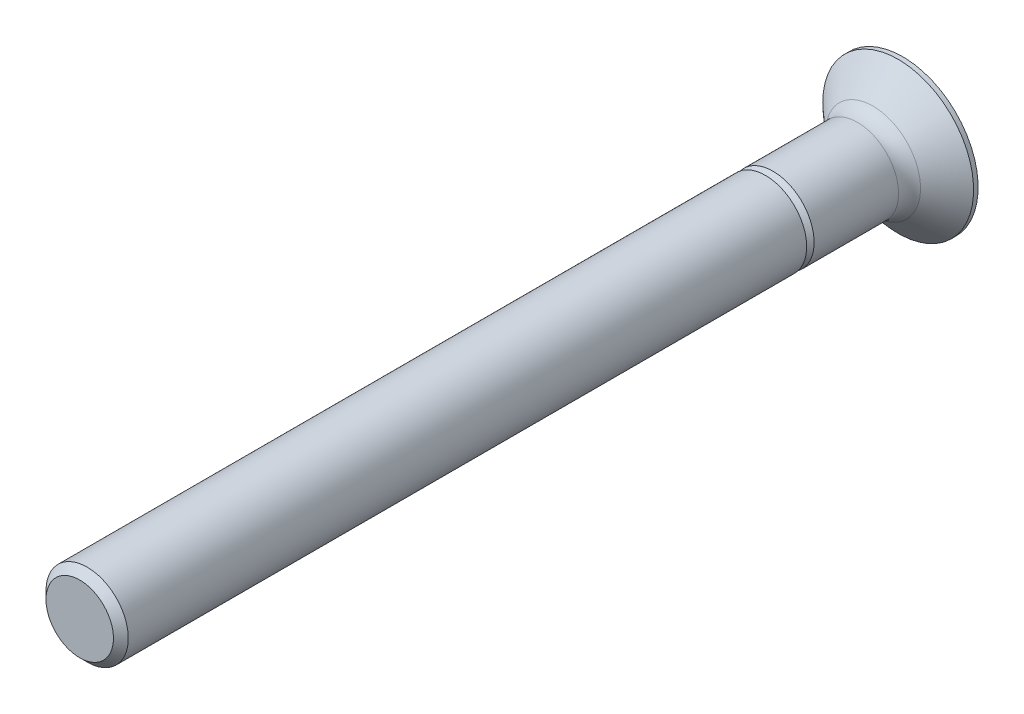
ISO-10303-21;
HEADER;
FILE_DESCRIPTION(('STEP AP214'),'2;1');
FILE_NAME('part.step','',(''),(''),'','','');
FILE_SCHEMA(('AUTOMOTIVE_DESIGN { 1 0 10303 214 1 1 1 1 }'));
ENDSEC;
DATA;
#1=APPLICATION_CONTEXT('core data for automotive mechanical design processes');
#2=APPLICATION_PROTOCOL_DEFINITION('international standard','automotive_design',2000,#1);
#3=PRODUCT_CONTEXT('',#1,'mechanical');
#4=PRODUCT('Part','Part','',(#3));
#5=PRODUCT_RELATED_PRODUCT_CATEGORY('part','',(#4));
#6=PRODUCT_DEFINITION_FORMATION('','',#4);
#7=PRODUCT_DEFINITION_CONTEXT('part definition',#1,'design');
#8=PRODUCT_DEFINITION('design','',#6,#7);
#9=PRODUCT_DEFINITION_SHAPE('','',#8);
#10=(LENGTH_UNIT() NAMED_UNIT(*) SI_UNIT(.MILLI.,.METRE.));
#11=(NAMED_UNIT(*) PLANE_ANGLE_UNIT() SI_UNIT($,.RADIAN.));
#12=(NAMED_UNIT(*) SI_UNIT($,.STERADIAN.) SOLID_ANGLE_UNIT());
#13=UNCERTAINTY_MEASURE_WITH_UNIT(LENGTH_MEASURE(1.E-05),#10,'distance_accuracy_value','');
#14=(GEOMETRIC_REPRESENTATION_CONTEXT(3) GLOBAL_UNCERTAINTY_ASSIGNED_CONTEXT((#13)) GLOBAL_UNIT_ASSIGNED_CONTEXT((#10,
#11,#12)) REPRESENTATION_CONTEXT('',''));
#15=CARTESIAN_POINT('',(0.,0.,0.));
#16=DIRECTION('',(0.,0.,1.));
#17=DIRECTION('',(1.,0.,0.));
#18=AXIS2_PLACEMENT_3D('',#15,#16,#17);
#19=CARTESIAN_POINT('',(0.,2.75,0.));
#20=DIRECTION('',(0.,0.,1.));
#21=DIRECTION('',(1.,0.,0.));
#22=AXIS2_PLACEMENT_3D('',#19,#20,#21);
#23=PLANE('',#22);
#24=CARTESIAN_POINT('',(0.,0.,0.));
#25=DIRECTION('',(0.,0.,-1.));
#26=DIRECTION('',(-1.,0.,0.));
#27=AXIS2_PLACEMENT_3D('',#24,#25,#26);
#28=CIRCLE('',#27,2.75);
#29=CARTESIAN_POINT('',(-2.75,0.,0.));
#30=VERTEX_POINT('',#29);
#31=EDGE_CURVE('E235',#30,#30,#28,.T.);
#32=ORIENTED_EDGE('',*,*,#31,.T.);
#33=EDGE_LOOP('',(#32));
#34=FACE_BOUND('',#33,.T.);
#35=DIRECTION('',(0.422618261740699,0.90630778703665,0.));
#36=VECTOR('',#35,1.);
#37=CARTESIAN_POINT('',(0.266666666666666,-1.6,0.));
#38=LINE('',#37,#36);
#39=CARTESIAN_POINT('',(0.266666666666666,-1.6,0.));
#40=VERTEX_POINT('',#39);
#41=CARTESIAN_POINT('',(0.690686510489199,-0.690686510489199,0.));
#42=VERTEX_POINT('',#41);
#43=EDGE_CURVE('E30',#40,#42,#38,.T.);
#44=ORIENTED_EDGE('',*,*,#43,.T.);
#45=DIRECTION('',(0.90630778703665,0.422618261740699,0.));
#46=VECTOR('',#45,1.);
#47=CARTESIAN_POINT('',(0.690686510489199,-0.690686510489199,0.));
#48=LINE('',#47,#46);
#49=CARTESIAN_POINT('',(1.6,-0.266666666666667,0.));
#50=VERTEX_POINT('',#49);
#51=EDGE_CURVE('E161',#42,#50,#48,.T.);
#52=ORIENTED_EDGE('',*,*,#51,.T.);
#53=DIRECTION('',(0.,1.,0.));
#54=VECTOR('',#53,1.);
#55=CARTESIAN_POINT('',(1.6,-0.266666666666667,0.));
#56=LINE('',#55,#54);
#57=CARTESIAN_POINT('',(1.6,0.266666666666666,0.));
#58=VERTEX_POINT('',#57);
#59=EDGE_CURVE('E157',#50,#58,#56,.T.);
#60=ORIENTED_EDGE('',*,*,#59,.T.);
#61=DIRECTION('',(-0.90630778703665,0.422618261740699,0.));
#62=VECTOR('',#61,1.);
#63=CARTESIAN_POINT('',(1.6,0.266666666666666,0.));
#64=LINE('',#63,#62);
#65=CARTESIAN_POINT('',(0.690686510489199,0.690686510489198,0.));
#66=VERTEX_POINT('',#65);
#67=EDGE_CURVE('E153',#58,#66,#64,.T.);
#68=ORIENTED_EDGE('',*,*,#67,.T.);
#69=DIRECTION('',(-0.422618261740699,0.90630778703665,0.));
#70=VECTOR('',#69,1.);
#71=CARTESIAN_POINT('',(0.690686510489199,0.690686510489198,0.));
#72=LINE('',#71,#70);
#73=CARTESIAN_POINT('',(0.266666666666667,1.6,0.));
#74=VERTEX_POINT('',#73);
#75=EDGE_CURVE('E149',#66,#74,#72,.T.);
#76=ORIENTED_EDGE('',*,*,#75,.T.);
#77=DIRECTION('',(-1.,0.,0.));
#78=VECTOR('',#77,1.);
#79=CARTESIAN_POINT('',(0.266666666666667,1.6,0.));
#80=LINE('',#79,#78);
#81=CARTESIAN_POINT('',(-0.266666666666666,1.6,0.));
#82=VERTEX_POINT('',#81);
#83=EDGE_CURVE('E145',#74,#82,#80,.T.);
#84=ORIENTED_EDGE('',*,*,#83,.T.);
#85=DIRECTION('',(-0.422618261740699,-0.90630778703665,0.));
#86=VECTOR('',#85,1.);
#87=CARTESIAN_POINT('',(-0.266666666666666,1.6,0.));
#88=LINE('',#87,#86);
#89=CARTESIAN_POINT('',(-0.690686510489197,0.690686510489199,0.));
#90=VERTEX_POINT('',#89);
#91=EDGE_CURVE('E141',#82,#90,#88,.T.);
#92=ORIENTED_EDGE('',*,*,#91,.T.);
#93=DIRECTION('',(-0.90630778703665,-0.422618261740699,0.));
#94=VECTOR('',#93,1.);
#95=CARTESIAN_POINT('',(-0.690686510489197,0.690686510489199,0.));
#96=LINE('',#95,#94);
#97=CARTESIAN_POINT('',(-1.6,0.266666666666667,0.));
#98=VERTEX_POINT('',#97);
#99=EDGE_CURVE('E137',#90,#98,#96,.T.);
#100=ORIENTED_EDGE('',*,*,#99,.T.);
#101=DIRECTION('',(0.,-1.,0.));
#102=VECTOR('',#101,1.);
#103=CARTESIAN_POINT('',(-1.6,0.266666666666667,0.));
#104=LINE('',#103,#102);
#105=CARTESIAN_POINT('',(-1.6,-0.266666666666666,0.));
#106=VERTEX_POINT('',#105);
#107=EDGE_CURVE('E132',#98,#106,#104,.T.);
#108=ORIENTED_EDGE('',*,*,#107,.T.);
#109=DIRECTION('',(0.90630778703665,-0.422618261740699,0.));
#110=VECTOR('',#109,1.);
#111=CARTESIAN_POINT('',(-1.6,-0.266666666666666,0.));
#112=LINE('',#111,#110);
#113=CARTESIAN_POINT('',(-0.690686510489199,-0.690686510489198,0.));
#114=VERTEX_POINT('',#113);
#115=EDGE_CURVE('E126',#106,#114,#112,.T.);
#116=ORIENTED_EDGE('',*,*,#115,.T.);
#117=DIRECTION('',(0.4226182617407,-0.90630778703665,0.));
#118=VECTOR('',#117,1.);
#119=CARTESIAN_POINT('',(-0.690686510489199,-0.690686510489198,0.));
#120=LINE('',#119,#118);
#121=CARTESIAN_POINT('',(-0.266666666666666,-1.6,0.));
#122=VERTEX_POINT('',#121);
#123=EDGE_CURVE('E109',#114,#122,#120,.T.);
#124=ORIENTED_EDGE('',*,*,#123,.T.);
#125=DIRECTION('',(1.,0.,0.));
#126=VECTOR('',#125,1.);
#127=CARTESIAN_POINT('',(-0.266666666666666,-1.6,0.));
#128=LINE('',#127,#126);
#129=EDGE_CURVE('E118',#122,#40,#128,.T.);
#130=ORIENTED_EDGE('',*,*,#129,.T.);
#131=EDGE_LOOP('',(#44,#52,#60,#68,#76,#84,#92,#100,#108,#116,#124,#130));
#132=FACE_BOUND('',#131,.T.);
#133=ADVANCED_FACE('F15',(#34,#132),#23,.F.);
#134=CARTESIAN_POINT('',(0.,0.,30.));
#135=DIRECTION('',(0.,0.,-1.));
#136=DIRECTION('',(-1.,0.,0.));
#137=AXIS2_PLACEMENT_3D('',#134,#135,#136);
#138=PLANE('',#137);
#139=CARTESIAN_POINT('',(0.,0.,30.));
#140=DIRECTION('',(0.,0.,-1.));
#141=DIRECTION('',(-1.,0.,0.));
#142=AXIS2_PLACEMENT_3D('',#139,#140,#141);
#143=CIRCLE('',#142,1.229375);
#144=CARTESIAN_POINT('',(-1.229375,0.,30.));
#145=VERTEX_POINT('',#144);
#146=EDGE_CURVE('E9',#145,#145,#143,.T.);
#147=ORIENTED_EDGE('',*,*,#146,.F.);
#148=EDGE_LOOP('',(#147));
#149=FACE_BOUND('',#148,.T.);
#150=ADVANCED_FACE('F274',(#149),#138,.F.);
#151=CARTESIAN_POINT('',(0.,0.,30.));
#152=DIRECTION('',(0.,0.,-1.));
#153=DIRECTION('',(-1.,0.,0.));
#154=AXIS2_PLACEMENT_3D('',#151,#152,#153);
#155=CONICAL_SURFACE('',#154,1.229375,0.785398163397457);
#156=CARTESIAN_POINT('',(0.,0.,29.729375));
#157=DIRECTION('',(0.,0.,-1.));
#158=DIRECTION('',(-1.,0.,0.));
#159=AXIS2_PLACEMENT_3D('',#156,#157,#158);
#160=CIRCLE('',#159,1.5);
#161=CARTESIAN_POINT('',(-1.5,0.,29.729375));
#162=VERTEX_POINT('',#161);
#163=EDGE_CURVE('E23',#162,#162,#160,.T.);
#164=ORIENTED_EDGE('',*,*,#163,.F.);
#165=EDGE_LOOP('',(#164));
#166=FACE_BOUND('',#165,.T.);
#167=ORIENTED_EDGE('',*,*,#146,.T.);
#168=EDGE_LOOP('',(#167));
#169=FACE_BOUND('',#168,.T.);
#170=ADVANCED_FACE('F271',(#166,#169),#155,.T.);
#171=CARTESIAN_POINT('',(0.,0.,0.));
#172=DIRECTION('',(0.,0.,-1.));
#173=DIRECTION('',(-1.,0.,0.));
#174=AXIS2_PLACEMENT_3D('',#171,#172,#173);
#175=CYLINDRICAL_SURFACE('',#174,1.5);
#176=CARTESIAN_POINT('',(0.,0.,5.));
#177=DIRECTION('',(0.,0.,-1.));
#178=DIRECTION('',(-1.,0.,0.));
#179=AXIS2_PLACEMENT_3D('',#176,#177,#178);
#180=CIRCLE('',#179,1.5);
#181=CARTESIAN_POINT('',(-1.5,0.,5.));
#182=VERTEX_POINT('',#181);
#183=EDGE_CURVE('E259',#182,#182,#180,.T.);
#184=ORIENTED_EDGE('',*,*,#183,.F.);
#185=EDGE_LOOP('',(#184));
#186=FACE_BOUND('',#185,.T.);
#187=ORIENTED_EDGE('',*,*,#163,.T.);
#188=EDGE_LOOP('',(#187));
#189=FACE_BOUND('',#188,.T.);
#190=ADVANCED_FACE('F269',(#186,#189),#175,.T.);
#191=CARTESIAN_POINT('',(0.,1.5,5.));
#192=DIRECTION('',(0.,0.,1.));
#193=DIRECTION('',(1.,0.,0.));
#194=AXIS2_PLACEMENT_3D('',#191,#192,#193);
#195=PLANE('',#194);
#196=CARTESIAN_POINT('',(0.,0.,5.));
#197=DIRECTION('',(0.,0.,-1.));
#198=DIRECTION('',(-1.,0.,0.));
#199=AXIS2_PLACEMENT_3D('',#196,#197,#198);
#200=CIRCLE('',#199,1.229375);
#201=CARTESIAN_POINT('',(-1.229375,0.,5.));
#202=VERTEX_POINT('',#201);
#203=EDGE_CURVE('E255',#202,#202,#200,.T.);
#204=ORIENTED_EDGE('',*,*,#203,.F.);
#205=EDGE_LOOP('',(#204));
#206=FACE_BOUND('',#205,.T.);
#207=ORIENTED_EDGE('',*,*,#183,.T.);
#208=EDGE_LOOP('',(#207));
#209=FACE_BOUND('',#208,.T.);
#210=ADVANCED_FACE('F287',(#206,#209),#195,.F.);
#211=CARTESIAN_POINT('',(0.,0.,5.));
#212=DIRECTION('',(0.,0.,-1.));
#213=DIRECTION('',(-1.,0.,0.));
#214=AXIS2_PLACEMENT_3D('',#211,#212,#213);
#215=CONICAL_SURFACE('',#214,1.229375,0.785398163397449);
#216=CARTESIAN_POINT('',(0.,0.,4.729375));
#217=DIRECTION('',(0.,0.,-1.));
#218=DIRECTION('',(-1.,0.,0.));
#219=AXIS2_PLACEMENT_3D('',#216,#217,#218);
#220=CIRCLE('',#219,1.5);
#221=CARTESIAN_POINT('',(-1.5,0.,4.729375));
#222=VERTEX_POINT('',#221);
#223=EDGE_CURVE('E251',#222,#222,#220,.T.);
#224=ORIENTED_EDGE('',*,*,#223,.F.);
#225=EDGE_LOOP('',(#224));
#226=FACE_BOUND('',#225,.T.);
#227=ORIENTED_EDGE('',*,*,#203,.T.);
#228=EDGE_LOOP('',(#227));
#229=FACE_BOUND('',#228,.T.);
#230=ADVANCED_FACE('F291',(#226,#229),#215,.T.);
#231=CARTESIAN_POINT('',(0.,0.,0.));
#232=DIRECTION('',(0.,0.,-1.));
#233=DIRECTION('',(-1.,0.,0.));
#234=AXIS2_PLACEMENT_3D('',#231,#232,#233);
#235=CYLINDRICAL_SURFACE('',#234,1.5);
#236=CARTESIAN_POINT('',(0.,0.,1.65));
#237=DIRECTION('',(0.,0.,-1.));
#238=DIRECTION('',(-1.,0.,0.));
#239=AXIS2_PLACEMENT_3D('',#236,#237,#238);
#240=CIRCLE('',#239,1.5);
#241=CARTESIAN_POINT('',(-1.5,0.,1.65));
#242=VERTEX_POINT('',#241);
#243=EDGE_CURVE('E247',#242,#242,#240,.T.);
#244=ORIENTED_EDGE('',*,*,#243,.F.);
#245=EDGE_LOOP('',(#244));
#246=FACE_BOUND('',#245,.T.);
#247=ORIENTED_EDGE('',*,*,#223,.T.);
#248=EDGE_LOOP('',(#247));
#249=FACE_BOUND('',#248,.T.);
#250=ADVANCED_FACE('F295',(#246,#249),#235,.T.);
#251=CARTESIAN_POINT('',(0.,0.,1.65));
#252=DIRECTION('',(0.,0.,-1.));
#253=DIRECTION('',(-1.,0.,0.));
#254=AXIS2_PLACEMENT_3D('',#251,#252,#253);
#255=TOROIDAL_SURFACE('',#254,2.3,0.8);
#256=ORIENTED_EDGE('',*,*,#243,.T.);
#257=EDGE_LOOP('',(#256));
#258=FACE_BOUND('',#257,.T.);
#259=CARTESIAN_POINT('',(0.,0.,1.08431457505076));
#260=DIRECTION('',(0.,0.,-1.));
#261=DIRECTION('',(-1.,0.,0.));
#262=AXIS2_PLACEMENT_3D('',#259,#260,#261);
#263=CIRCLE('',#262,1.73431457505076);
#264=CARTESIAN_POINT('',(-1.73431457505076,0.,1.08431457505076));
#265=VERTEX_POINT('',#264);
#266=EDGE_CURVE('E243',#265,#265,#263,.T.);
#267=ORIENTED_EDGE('',*,*,#266,.F.);
#268=EDGE_LOOP('',(#267));
#269=FACE_BOUND('',#268,.T.);
#270=ADVANCED_FACE('F299',(#258,#269),#255,.F.);
#271=CARTESIAN_POINT('',(0.,0.,1.08431457505076));
#272=DIRECTION('',(0.,0.,-1.));
#273=DIRECTION('',(-1.,0.,0.));
#274=AXIS2_PLACEMENT_3D('',#271,#272,#273);
#275=CONICAL_SURFACE('',#274,1.73431457505076,0.835161102643237);
#276=CARTESIAN_POINT('',(0.,0.,0.165));
#277=DIRECTION('',(0.,0.,-1.));
#278=DIRECTION('',(-1.,0.,0.));
#279=AXIS2_PLACEMENT_3D('',#276,#277,#278);
#280=CIRCLE('',#279,2.75);
#281=CARTESIAN_POINT('',(-2.75,0.,0.165));
#282=VERTEX_POINT('',#281);
#283=EDGE_CURVE('E239',#282,#282,#280,.T.);
#284=ORIENTED_EDGE('',*,*,#283,.F.);
#285=EDGE_LOOP('',(#284));
#286=FACE_BOUND('',#285,.T.);
#287=ORIENTED_EDGE('',*,*,#266,.T.);
#288=EDGE_LOOP('',(#287));
#289=FACE_BOUND('',#288,.T.);
#290=ADVANCED_FACE('F303',(#286,#289),#275,.T.);
#291=CARTESIAN_POINT('',(0.,0.,0.));
#292=DIRECTION('',(0.,0.,-1.));
#293=DIRECTION('',(-1.,0.,0.));
#294=AXIS2_PLACEMENT_3D('',#291,#292,#293);
#295=CYLINDRICAL_SURFACE('',#294,2.75);
#296=ORIENTED_EDGE('',*,*,#31,.F.);
#297=EDGE_LOOP('',(#296));
#298=FACE_BOUND('',#297,.T.);
#299=ORIENTED_EDGE('',*,*,#283,.T.);
#300=EDGE_LOOP('',(#299));
#301=FACE_BOUND('',#300,.T.);
#302=ADVANCED_FACE('F307',(#298,#301),#295,.T.);
#303=CARTESIAN_POINT('',(0.266666666666666,-1.6,0.));
#304=DIRECTION('',(-0.875426098065593,0.408217893676735,-0.258819045102521));
#305=DIRECTION('',(-0.422618261740699,-0.90630778703665,0.));
#306=AXIS2_PLACEMENT_3D('',#303,#304,#305);
#307=PLANE('',#306);
#308=DIRECTION('',(0.422618261740699,0.90630778703665,0.));
#309=VECTOR('',#308,1.);
#310=CARTESIAN_POINT('',(0.0311291837482248,-1.02727469648858,1.7));
#311=LINE('',#310,#309);
#312=CARTESIAN_POINT('',(0.,-1.09403144646646,1.7));
#313=VERTEX_POINT('',#312);
#314=CARTESIAN_POINT('',(0.347918282300735,-0.347918282300735,1.7));
#315=VERTEX_POINT('',#314);
#316=EDGE_CURVE('E122',#313,#315,#311,.T.);
#317=ORIENTED_EDGE('',*,*,#316,.T.);
#318=DIRECTION('',(0.193899607686987,-0.193899607686987,-0.961668281829896));
#319=VECTOR('',#318,1.);
#320=CARTESIAN_POINT('',(0.708932123765797,-0.708932123765797,-0.0904913000080147));
#321=LINE('',#320,#319);
#322=EDGE_CURVE('E196',#315,#42,#321,.T.);
#323=ORIENTED_EDGE('',*,*,#322,.T.);
#324=ORIENTED_EDGE('',*,*,#43,.F.);
#325=DIRECTION('',(0.162689201767992,-0.255370893567974,-0.953057149569945));
#326=VECTOR('',#325,1.);
#327=CARTESIAN_POINT('',(0.266666666666666,-1.6,0.));
#328=LINE('',#327,#326);
#329=CARTESIAN_POINT('',(0.,-1.18141717943534,1.56217235352282));
#330=VERTEX_POINT('',#329);
#331=EDGE_CURVE('E115',#330,#40,#328,.T.);
#332=ORIENTED_EDGE('',*,*,#331,.F.);
#333=DIRECTION('',(0.,-0.535467009821226,-0.844556144606808));
#334=VECTOR('',#333,1.);
#335=CARTESIAN_POINT('',(0.,-2.00789955953988,0.25861721431901));
#336=LINE('',#335,#334);
#337=EDGE_CURVE('E36',#313,#330,#336,.T.);
#338=ORIENTED_EDGE('',*,*,#337,.F.);
#339=EDGE_LOOP('',(#317,#323,#324,#332,#338));
#340=FACE_BOUND('',#339,.T.);
#341=ADVANCED_FACE('F311',(#340),#307,.T.);
#342=CARTESIAN_POINT('',(0.690686510489199,-0.690686510489199,0.));
#343=DIRECTION('',(-0.408217893676735,0.875426098065593,-0.258819045102521));
#344=DIRECTION('',(-0.90630778703665,-0.422618261740699,0.));
#345=AXIS2_PLACEMENT_3D('',#342,#343,#344);
#346=PLANE('',#345);
#347=DIRECTION('',(0.535467009821226,0.,-0.844556144606808));
#348=VECTOR('',#347,1.);
#349=CARTESIAN_POINT('',(2.00789955953988,0.,0.25861721431901));
#350=LINE('',#349,#348);
#351=CARTESIAN_POINT('',(1.09403144646646,0.,1.7));
#352=VERTEX_POINT('',#351);
#353=CARTESIAN_POINT('',(1.18141717943534,0.,1.56217235352282));
#354=VERTEX_POINT('',#353);
#355=EDGE_CURVE('E226',#352,#354,#350,.T.);
#356=ORIENTED_EDGE('',*,*,#355,.T.);
#357=DIRECTION('',(0.255370893567974,-0.162689201767992,-0.953057149569945));
#358=VECTOR('',#357,1.);
#359=CARTESIAN_POINT('',(1.6,-0.266666666666667,0.));
#360=LINE('',#359,#358);
#361=EDGE_CURVE('E193',#354,#50,#360,.T.);
#362=ORIENTED_EDGE('',*,*,#361,.T.);
#363=ORIENTED_EDGE('',*,*,#51,.F.);
#364=ORIENTED_EDGE('',*,*,#322,.F.);
#365=DIRECTION('',(0.90630778703665,0.422618261740699,0.));
#366=VECTOR('',#365,1.);
#367=CARTESIAN_POINT('',(0.0928666510036984,-0.466850811199468,1.7));
#368=LINE('',#367,#366);
#369=EDGE_CURVE('E201',#315,#352,#368,.T.);
#370=ORIENTED_EDGE('',*,*,#369,.T.);
#371=EDGE_LOOP('',(#356,#362,#363,#364,#370));
#372=FACE_BOUND('',#371,.T.);
#373=ADVANCED_FACE('F315',(#372),#346,.T.);
#374=CARTESIAN_POINT('',(1.6,-0.266666666666667,0.));
#375=DIRECTION('',(-0.965925826289068,0.,-0.258819045102521));
#376=DIRECTION('',(-0.258819045102521,0.,0.965925826289068));
#377=AXIS2_PLACEMENT_3D('',#374,#375,#376);
#378=PLANE('',#377);
#379=ORIENTED_EDGE('',*,*,#59,.F.);
#380=ORIENTED_EDGE('',*,*,#361,.F.);
#381=DIRECTION('',(0.255370893567974,0.162689201767992,-0.953057149569945));
#382=VECTOR('',#381,1.);
#383=CARTESIAN_POINT('',(1.6,0.266666666666666,0.));
#384=LINE('',#383,#382);
#385=EDGE_CURVE('E190',#354,#58,#384,.T.);
#386=ORIENTED_EDGE('',*,*,#385,.T.);
#387=EDGE_LOOP('',(#379,#380,#386));
#388=FACE_BOUND('',#387,.T.);
#389=ADVANCED_FACE('F318',(#388),#378,.T.);
#390=CARTESIAN_POINT('',(1.6,0.266666666666666,0.));
#391=DIRECTION('',(-0.408217893676735,-0.875426098065593,-0.258819045102521));
#392=DIRECTION('',(0.90630778703665,-0.422618261740699,0.));
#393=AXIS2_PLACEMENT_3D('',#390,#391,#392);
#394=PLANE('',#393);
#395=DIRECTION('',(-0.90630778703665,0.422618261740699,0.));
#396=VECTOR('',#395,1.);
#397=CARTESIAN_POINT('',(1.02727469648858,0.0311291837482241,1.7));
#398=LINE('',#397,#396);
#399=CARTESIAN_POINT('',(0.347918282300735,0.347918282300735,1.7));
#400=VERTEX_POINT('',#399);
#401=EDGE_CURVE('E205',#352,#400,#398,.T.);
#402=ORIENTED_EDGE('',*,*,#401,.T.);
#403=DIRECTION('',(0.193899607686987,0.193899607686987,-0.961668281829896));
#404=VECTOR('',#403,1.);
#405=CARTESIAN_POINT('',(0.708932123765798,0.708932123765797,-0.0904913000080147));
#406=LINE('',#405,#404);
#407=EDGE_CURVE('E187',#400,#66,#406,.T.);
#408=ORIENTED_EDGE('',*,*,#407,.T.);
#409=ORIENTED_EDGE('',*,*,#67,.F.);
#410=ORIENTED_EDGE('',*,*,#385,.F.);
#411=ORIENTED_EDGE('',*,*,#355,.F.);
#412=EDGE_LOOP('',(#402,#408,#409,#410,#411));
#413=FACE_BOUND('',#412,.T.);
#414=ADVANCED_FACE('F322',(#413),#394,.T.);
#415=CARTESIAN_POINT('',(0.690686510489199,0.690686510489198,0.));
#416=DIRECTION('',(-0.875426098065593,-0.408217893676735,-0.258819045102521));
#417=DIRECTION('',(0.422618261740699,-0.90630778703665,0.));
#418=AXIS2_PLACEMENT_3D('',#415,#416,#417);
#419=PLANE('',#418);
#420=DIRECTION('',(0.,0.535467009821226,-0.844556144606808));
#421=VECTOR('',#420,1.);
#422=CARTESIAN_POINT('',(0.,2.00789955953988,0.25861721431901));
#423=LINE('',#422,#421);
#424=CARTESIAN_POINT('',(0.,1.09403144646646,1.7));
#425=VERTEX_POINT('',#424);
#426=CARTESIAN_POINT('',(0.,1.18141717943534,1.56217235352282));
#427=VERTEX_POINT('',#426);
#428=EDGE_CURVE('E229',#425,#427,#423,.T.);
#429=ORIENTED_EDGE('',*,*,#428,.T.);
#430=DIRECTION('',(0.162689201767992,0.255370893567974,-0.953057149569945));
#431=VECTOR('',#430,1.);
#432=CARTESIAN_POINT('',(0.266666666666667,1.6,0.));
#433=LINE('',#432,#431);
#434=EDGE_CURVE('E184',#427,#74,#433,.T.);
#435=ORIENTED_EDGE('',*,*,#434,.T.);
#436=ORIENTED_EDGE('',*,*,#75,.F.);
#437=ORIENTED_EDGE('',*,*,#407,.F.);
#438=DIRECTION('',(-0.422618261740699,0.90630778703665,0.));
#439=VECTOR('',#438,1.);
#440=CARTESIAN_POINT('',(0.965537229233103,-0.976569823633555,1.7));
#441=LINE('',#440,#439);
#442=EDGE_CURVE('E208',#400,#425,#441,.T.);
#443=ORIENTED_EDGE('',*,*,#442,.T.);
#444=EDGE_LOOP('',(#429,#435,#436,#437,#443));
#445=FACE_BOUND('',#444,.T.);
#446=ADVANCED_FACE('F326',(#445),#419,.T.);
#447=CARTESIAN_POINT('',(0.266666666666667,1.6,0.));
#448=DIRECTION('',(0.,-0.965925826289068,-0.258819045102521));
#449=DIRECTION('',(0.,0.258819045102521,-0.965925826289068));
#450=AXIS2_PLACEMENT_3D('',#447,#448,#449);
#451=PLANE('',#450);
#452=ORIENTED_EDGE('',*,*,#83,.F.);
#453=ORIENTED_EDGE('',*,*,#434,.F.);
#454=DIRECTION('',(-0.162689201767992,0.255370893567974,-0.953057149569945));
#455=VECTOR('',#454,1.);
#456=CARTESIAN_POINT('',(-0.266666666666666,1.6,0.));
#457=LINE('',#456,#455);
#458=EDGE_CURVE('E181',#427,#82,#457,.T.);
#459=ORIENTED_EDGE('',*,*,#458,.T.);
#460=EDGE_LOOP('',(#452,#453,#459));
#461=FACE_BOUND('',#460,.T.);
#462=ADVANCED_FACE('F330',(#461),#451,.T.);
#463=CARTESIAN_POINT('',(-0.266666666666666,1.6,0.));
#464=DIRECTION('',(0.875426098065593,-0.408217893676735,-0.258819045102521));
#465=DIRECTION('',(0.422618261740699,0.90630778703665,0.));
#466=AXIS2_PLACEMENT_3D('',#463,#464,#465);
#467=PLANE('',#466);
#468=DIRECTION('',(-0.422618261740699,-0.90630778703665,0.));
#469=VECTOR('',#468,1.);
#470=CARTESIAN_POINT('',(-0.806947526414821,-0.636473108418201,1.7));
#471=LINE('',#470,#469);
#472=CARTESIAN_POINT('',(-0.347918282300733,0.347918282300735,1.7));
#473=VERTEX_POINT('',#472);
#474=EDGE_CURVE('E212',#425,#473,#471,.T.);
#475=ORIENTED_EDGE('',*,*,#474,.T.);
#476=DIRECTION('',(-0.193899607686987,0.193899607686987,-0.961668281829896));
#477=VECTOR('',#476,1.);
#478=CARTESIAN_POINT('',(-0.708932123765796,0.708932123765798,-0.0904913000080149));
#479=LINE('',#478,#477);
#480=EDGE_CURVE('E178',#473,#90,#479,.T.);
#481=ORIENTED_EDGE('',*,*,#480,.T.);
#482=ORIENTED_EDGE('',*,*,#91,.F.);
#483=ORIENTED_EDGE('',*,*,#458,.F.);
#484=ORIENTED_EDGE('',*,*,#428,.F.);
#485=EDGE_LOOP('',(#475,#481,#482,#483,#484));
#486=FACE_BOUND('',#485,.T.);
#487=ADVANCED_FACE('F334',(#486),#467,.T.);
#488=CARTESIAN_POINT('',(-0.690686510489197,0.690686510489199,0.));
#489=DIRECTION('',(0.408217893676735,-0.875426098065593,-0.258819045102521));
#490=DIRECTION('',(0.90630778703665,0.422618261740699,0.));
#491=AXIS2_PLACEMENT_3D('',#488,#489,#490);
#492=PLANE('',#491);
#493=DIRECTION('',(-0.535467009821226,0.,-0.844556144606808));
#494=VECTOR('',#493,1.);
#495=CARTESIAN_POINT('',(-2.00789955953988,0.,0.25861721431901));
#496=LINE('',#495,#494);
#497=CARTESIAN_POINT('',(-1.09403144646646,0.,1.7));
#498=VERTEX_POINT('',#497);
#499=CARTESIAN_POINT('',(-1.18141717943534,0.,1.56217235352282));
#500=VERTEX_POINT('',#499);
#501=EDGE_CURVE('E232',#498,#500,#496,.T.);
#502=ORIENTED_EDGE('',*,*,#501,.T.);
#503=DIRECTION('',(-0.255370893567974,0.162689201767992,-0.953057149569945));
#504=VECTOR('',#503,1.);
#505=CARTESIAN_POINT('',(-1.6,0.266666666666667,0.));
#506=LINE('',#505,#504);
#507=EDGE_CURVE('E175',#500,#98,#506,.T.);
#508=ORIENTED_EDGE('',*,*,#507,.T.);
#509=ORIENTED_EDGE('',*,*,#99,.F.);
#510=ORIENTED_EDGE('',*,*,#480,.F.);
#511=DIRECTION('',(-0.90630778703665,-0.422618261740699,0.));
#512=VECTOR('',#511,1.);
#513=CARTESIAN_POINT('',(-0.297934937066678,0.37122589896358,1.7));
#514=LINE('',#513,#512);
#515=EDGE_CURVE('E215',#473,#498,#514,.T.);
#516=ORIENTED_EDGE('',*,*,#515,.T.);
#517=EDGE_LOOP('',(#502,#508,#509,#510,#516));
#518=FACE_BOUND('',#517,.T.);
#519=ADVANCED_FACE('F338',(#518),#492,.T.);
#520=CARTESIAN_POINT('',(-1.6,0.266666666666667,0.));
#521=DIRECTION('',(0.965925826289068,0.,-0.258819045102521));
#522=DIRECTION('',(-0.258819045102521,0.,-0.965925826289068));
#523=AXIS2_PLACEMENT_3D('',#520,#521,#522);
#524=PLANE('',#523);
#525=ORIENTED_EDGE('',*,*,#107,.F.);
#526=ORIENTED_EDGE('',*,*,#507,.F.);
#527=DIRECTION('',(-0.255370893567974,-0.162689201767992,-0.953057149569945));
#528=VECTOR('',#527,1.);
#529=CARTESIAN_POINT('',(-1.6,-0.266666666666666,0.));
#530=LINE('',#529,#528);
#531=EDGE_CURVE('E172',#500,#106,#530,.T.);
#532=ORIENTED_EDGE('',*,*,#531,.T.);
#533=EDGE_LOOP('',(#525,#526,#532));
#534=FACE_BOUND('',#533,.T.);
#535=ADVANCED_FACE('F342',(#534),#524,.T.);
#536=CARTESIAN_POINT('',(-1.6,-0.266666666666666,0.));
#537=DIRECTION('',(0.408217893676735,0.875426098065593,-0.258819045102521));
#538=DIRECTION('',(-0.90630778703665,0.422618261740699,0.));
#539=AXIS2_PLACEMENT_3D('',#536,#537,#538);
#540=PLANE('',#539);
#541=DIRECTION('',(0.90630778703665,-0.422618261740699,0.));
#542=VECTOR('',#541,1.);
#543=CARTESIAN_POINT('',(0.6364731084182,-0.806947526414823,1.7));
#544=LINE('',#543,#542);
#545=CARTESIAN_POINT('',(-0.347918282300735,-0.347918282300734,1.7));
#546=VERTEX_POINT('',#545);
#547=EDGE_CURVE('E219',#498,#546,#544,.T.);
#548=ORIENTED_EDGE('',*,*,#547,.T.);
#549=DIRECTION('',(-0.193899607686987,-0.193899607686987,-0.961668281829896));
#550=VECTOR('',#549,1.);
#551=CARTESIAN_POINT('',(-0.708932123765798,-0.708932123765797,-0.0904913000080147));
#552=LINE('',#551,#550);
#553=EDGE_CURVE('E114',#546,#114,#552,.T.);
#554=ORIENTED_EDGE('',*,*,#553,.T.);
#555=ORIENTED_EDGE('',*,*,#115,.F.);
#556=ORIENTED_EDGE('',*,*,#531,.F.);
#557=ORIENTED_EDGE('',*,*,#501,.F.);
#558=EDGE_LOOP('',(#548,#554,#555,#556,#557));
#559=FACE_BOUND('',#558,.T.);
#560=ADVANCED_FACE('F346',(#559),#540,.T.);
#561=CARTESIAN_POINT('',(-0.690686510489199,-0.690686510489198,0.));
#562=DIRECTION('',(0.875426098065593,0.408217893676735,-0.258819045102521));
#563=DIRECTION('',(-0.422618261740699,0.90630778703665,0.));
#564=AXIS2_PLACEMENT_3D('',#561,#562,#563);
#565=PLANE('',#564);
#566=ORIENTED_EDGE('',*,*,#337,.T.);
#567=DIRECTION('',(-0.162689201767992,-0.255370893567974,-0.953057149569945));
#568=VECTOR('',#567,1.);
#569=CARTESIAN_POINT('',(-0.266666666666666,-1.6,0.));
#570=LINE('',#569,#568);
#571=EDGE_CURVE('E104',#330,#122,#570,.T.);
#572=ORIENTED_EDGE('',*,*,#571,.T.);
#573=ORIENTED_EDGE('',*,*,#123,.F.);
#574=ORIENTED_EDGE('',*,*,#553,.F.);
#575=DIRECTION('',(0.422618261740699,-0.90630778703665,0.));
#576=VECTOR('',#575,1.);
#577=CARTESIAN_POINT('',(0.127460519070055,-1.36737141170393,1.7));
#578=LINE('',#577,#576);
#579=EDGE_CURVE('E168',#546,#313,#578,.T.);
#580=ORIENTED_EDGE('',*,*,#579,.T.);
#581=EDGE_LOOP('',(#566,#572,#573,#574,#580));
#582=FACE_BOUND('',#581,.T.);
#583=ADVANCED_FACE('F106',(#582),#565,.T.);
#584=CARTESIAN_POINT('',(-0.266666666666666,-1.6,0.));
#585=DIRECTION('',(0.,0.965925826289068,-0.258819045102521));
#586=DIRECTION('',(0.,0.258819045102521,0.965925826289068));
#587=AXIS2_PLACEMENT_3D('',#584,#585,#586);
#588=PLANE('',#587);
#589=ORIENTED_EDGE('',*,*,#129,.F.);
#590=ORIENTED_EDGE('',*,*,#571,.F.);
#591=ORIENTED_EDGE('',*,*,#331,.T.);
#592=EDGE_LOOP('',(#589,#590,#591));
#593=FACE_BOUND('',#592,.T.);
#594=ADVANCED_FACE('F119',(#593),#588,.T.);
#595=CARTESIAN_POINT('',(0.443964731120089,-1.21978307378669,1.7));
#596=DIRECTION('',(0.,0.,-1.));
#597=DIRECTION('',(-1.,0.,0.));
#598=AXIS2_PLACEMENT_3D('',#595,#596,#597);
#599=PLANE('',#598);
#600=ORIENTED_EDGE('',*,*,#579,.F.);
#601=ORIENTED_EDGE('',*,*,#547,.F.);
#602=ORIENTED_EDGE('',*,*,#515,.F.);
#603=ORIENTED_EDGE('',*,*,#474,.F.);
#604=ORIENTED_EDGE('',*,*,#442,.F.);
#605=ORIENTED_EDGE('',*,*,#401,.F.);
#606=ORIENTED_EDGE('',*,*,#369,.F.);
#607=ORIENTED_EDGE('',*,*,#316,.F.);
#608=EDGE_LOOP('',(#600,#601,#602,#603,#604,#605,#606,#607));
#609=FACE_BOUND('',#608,.T.);
#610=ADVANCED_FACE('F355',(#609),#599,.T.);
#611=CLOSED_SHELL('',(#133,#150,#170,#190,#210,#230,#250,#270,#290,#302,#341,#373,#389,#414,
#446,#462,#487,#519,#535,#560,#583,#594,#610));
#612=MANIFOLD_SOLID_BREP('B1',#611);
#613=ADVANCED_BREP_SHAPE_REPRESENTATION('',(#18,#612),#14);
#614=SHAPE_DEFINITION_REPRESENTATION(#9,#613);
ENDSEC;
END-ISO-10303-21;
